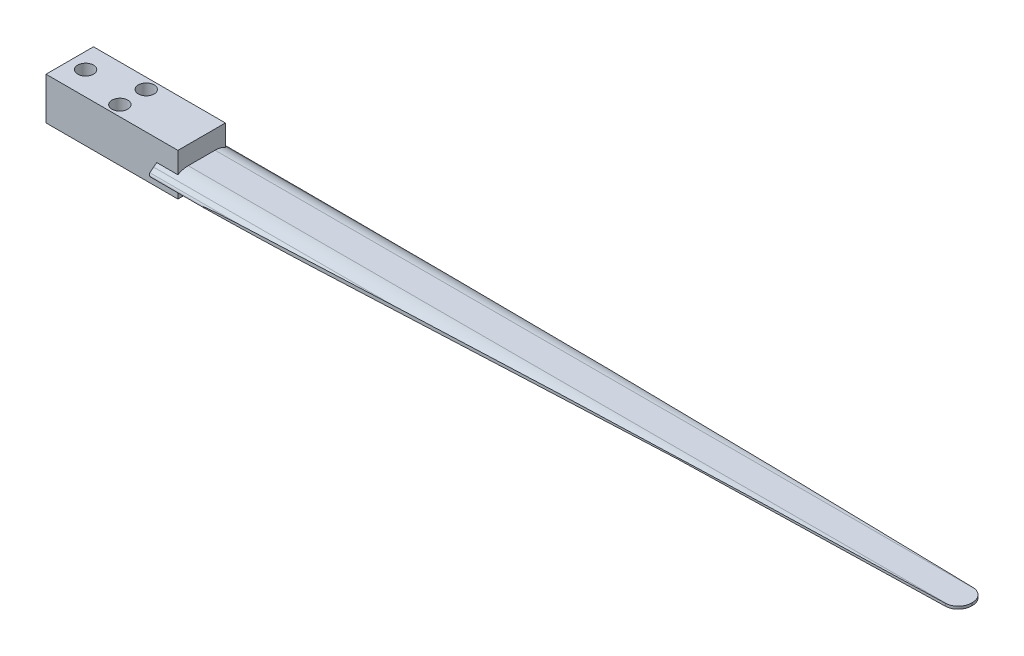
ISO-10303-21;
HEADER;
FILE_DESCRIPTION(('STEP AP214'),'2;1');
FILE_NAME('part.step','',(''),(''),'','','');
FILE_SCHEMA(('AUTOMOTIVE_DESIGN { 1 0 10303 214 1 1 1 1 }'));
ENDSEC;
DATA;
#1=APPLICATION_CONTEXT('core data for automotive mechanical design processes');
#2=APPLICATION_PROTOCOL_DEFINITION('international standard','automotive_design',2000,#1);
#3=PRODUCT_CONTEXT('',#1,'mechanical');
#4=PRODUCT('Part','Part','',(#3));
#5=PRODUCT_RELATED_PRODUCT_CATEGORY('part','',(#4));
#6=PRODUCT_DEFINITION_FORMATION('','',#4);
#7=PRODUCT_DEFINITION_CONTEXT('part definition',#1,'design');
#8=PRODUCT_DEFINITION('design','',#6,#7);
#9=PRODUCT_DEFINITION_SHAPE('','',#8);
#10=(LENGTH_UNIT() NAMED_UNIT(*) SI_UNIT(.MILLI.,.METRE.));
#11=(NAMED_UNIT(*) PLANE_ANGLE_UNIT() SI_UNIT($,.RADIAN.));
#12=(NAMED_UNIT(*) SI_UNIT($,.STERADIAN.) SOLID_ANGLE_UNIT());
#13=UNCERTAINTY_MEASURE_WITH_UNIT(LENGTH_MEASURE(1.E-05),#10,'distance_accuracy_value','');
#14=(GEOMETRIC_REPRESENTATION_CONTEXT(3) GLOBAL_UNCERTAINTY_ASSIGNED_CONTEXT((#13)) GLOBAL_UNIT_ASSIGNED_CONTEXT((#10,
#11,#12)) REPRESENTATION_CONTEXT('',''));
#15=CARTESIAN_POINT('',(0.,0.,0.));
#16=DIRECTION('',(0.,0.,1.));
#17=DIRECTION('',(1.,0.,0.));
#18=AXIS2_PLACEMENT_3D('',#15,#16,#17);
#19=CARTESIAN_POINT('',(1500.,-45.,-23.6213394580209));
#20=DIRECTION('',(1.,0.,0.));
#21=DIRECTION('',(0.,0.,-1.));
#22=AXIS2_PLACEMENT_3D('',#19,#20,#21);
#23=CYLINDRICAL_SURFACE('',#22,40.);
#24=CARTESIAN_POINT('',(40.,-45.,-23.6213394580209));
#25=DIRECTION('',(-1.,0.,0.));
#26=DIRECTION('',(0.,0.,1.));
#27=AXIS2_PLACEMENT_3D('',#24,#25,#26);
#28=CIRCLE('',#27,40.);
#29=CARTESIAN_POINT('',(40.,-11.1924139662292,-45.));
#30=VERTEX_POINT('',#29);
#31=CARTESIAN_POINT('',(40.,-5.,-23.6213394580209));
#32=VERTEX_POINT('',#31);
#33=EDGE_CURVE('E309',#30,#32,#28,.F.);
#34=ORIENTED_EDGE('',*,*,#33,.F.);
#35=DIRECTION('',(1.,0.,0.));
#36=VECTOR('',#35,1.);
#37=CARTESIAN_POINT('',(1500.,-11.1924139662292,-45.0000000000002));
#38=LINE('',#37,#36);
#39=CARTESIAN_POINT('',(0.,-11.1924139662291,-45.));
#40=VERTEX_POINT('',#39);
#41=EDGE_CURVE('E219',#40,#30,#38,.T.);
#42=ORIENTED_EDGE('',*,*,#41,.F.);
#43=CARTESIAN_POINT('',(0.,-45.,-23.6213394580209));
#44=DIRECTION('',(-1.,0.,0.));
#45=DIRECTION('',(0.,0.,1.));
#46=AXIS2_PLACEMENT_3D('',#43,#44,#45);
#47=CIRCLE('',#46,40.);
#48=CARTESIAN_POINT('',(0.,-14.3582222752409,-49.3328438454825));
#49=VERTEX_POINT('',#48);
#50=EDGE_CURVE('E398',#49,#40,#47,.F.);
#51=ORIENTED_EDGE('',*,*,#50,.F.);
#52=DIRECTION('',(-1.,0.,0.));
#53=VECTOR('',#52,1.);
#54=CARTESIAN_POINT('',(4.44089209850063E-13,-14.3582222752409,-49.3328438454825));
#55=LINE('',#54,#53);
#56=CARTESIAN_POINT('',(530.518621133797,-14.3582222752409,-49.3328438454825));
#57=VERTEX_POINT('',#56);
#58=EDGE_CURVE('E382',#57,#49,#55,.T.);
#59=ORIENTED_EDGE('',*,*,#58,.F.);
#60=CARTESIAN_POINT('',(1573.84636830917,-45.,-23.6213394580209));
#61=DIRECTION('',(0.0246362665328638,0.,-0.999696481123807));
#62=DIRECTION('',(0.999696481123807,0.,0.0246362665328638));
#63=AXIS2_PLACEMENT_3D('',#60,#61,#62);
#64=ELLIPSE('',#63,1623.62263562304,40.);
#65=CARTESIAN_POINT('',(1475.61590666332,-5.07331858080218,-26.042106041127));
#66=VERTEX_POINT('',#65);
#67=EDGE_CURVE('E332',#66,#57,#64,.F.);
#68=ORIENTED_EDGE('',*,*,#67,.F.);
#69=CARTESIAN_POINT('',(1475.61590666332,-5.07331858080218,-26.042106041127));
#70=CARTESIAN_POINT('',(1475.9700700259,-5.07279862859968,-26.0333826054804));
#71=CARTESIAN_POINT('',(1476.32404367951,-5.07180690533181,-26.0171221724049));
#72=CARTESIAN_POINT('',(1477.03097953139,-5.06897777633234,-25.9695770585497));
#73=CARTESIAN_POINT('',(1477.3839417231,-5.06714036512705,-25.9382922805256));
#74=CARTESIAN_POINT('',(1478.08841122464,-5.06271651587361,-25.8607270646541));
#75=CARTESIAN_POINT('',(1478.43991762994,-5.0601296674009,-25.8144384083733));
#76=CARTESIAN_POINT('',(1479.14061442849,-5.05437400914434,-25.7069642843364));
#77=CARTESIAN_POINT('',(1479.4898048499,-5.05120520644786,-25.6457789979973));
#78=CARTESIAN_POINT('',(1480.52090876374,-5.04124346477607,-25.4424078786907));
#79=CARTESIAN_POINT('',(1481.19875552388,-5.03390388093091,-25.2790304874285));
#80=CARTESIAN_POINT('',(1482.53799259359,-5.01986907112326,-24.8963572824213));
#81=CARTESIAN_POINT('',(1483.19939360256,-5.01317341763897,-24.6770989274508));
#82=CARTESIAN_POINT('',(1484.17135972117,-5.00573113413443,-24.3091875915255));
#83=CARTESIAN_POINT('',(1484.48981667851,-5.00368938011538,-24.1810833500194));
#84=CARTESIAN_POINT('',(1485.12256234085,-5.00082311444926,-23.9112888288626));
#85=CARTESIAN_POINT('',(1485.43682695597,-5.00000392433202,-23.7695419962997));
#86=CARTESIAN_POINT('',(1485.74806130917,-5.,-23.6213394580209));
#87=B_SPLINE_CURVE_WITH_KNOTS('',3,(#69,#70,#71,#72,#73,#74,#75,#76,#77,#78,#79,#80,#81,#82,#83,
#84,#85,#86),.UNSPECIFIED.,.F.,.F.,(4,2,2,2,2,2,2,2,4),(0.,1.06272685519985,2.12546058895862,
3.18877742580483,4.25208131380669,6.3413788539179,8.42927953870252,9.45881382358197,
10.492816487559),.UNSPECIFIED.);
#88=CARTESIAN_POINT('',(1485.74806130917,-5.,-23.6213394580209));
#89=VERTEX_POINT('',#88);
#90=EDGE_CURVE('E499',#66,#89,#87,.T.);
#91=ORIENTED_EDGE('',*,*,#90,.T.);
#92=DIRECTION('',(-1.,0.,0.));
#93=VECTOR('',#92,1.);
#94=CARTESIAN_POINT('',(1500.,-5.,-23.6213394580209));
#95=LINE('',#94,#93);
#96=EDGE_CURVE('E385',#32,#89,#95,.F.);
#97=ORIENTED_EDGE('',*,*,#96,.F.);
#98=EDGE_LOOP('',(#34,#42,#51,#59,#68,#91,#97));
#99=FACE_BOUND('',#98,.T.);
#100=ADVANCED_FACE('F42',(#99),#23,.F.);
#101=CARTESIAN_POINT('',(1500.,-40.,-25.4411906293519));
#102=DIRECTION('',(-1.,0.,0.));
#103=DIRECTION('',(0.,0.,1.));
#104=AXIS2_PLACEMENT_3D('',#101,#102,#103);
#105=CYLINDRICAL_SURFACE('',#104,40.);
#106=DIRECTION('',(-1.,0.,0.));
#107=VECTOR('',#106,1.);
#108=CARTESIAN_POINT('',(1500.,-5.10798119909597,-45.0000000000002));
#109=LINE('',#108,#107);
#110=CARTESIAN_POINT('',(0.,-5.10798119909588,-45.));
#111=VERTEX_POINT('',#110);
#112=CARTESIAN_POINT('',(40.,-5.10798119909597,-45.));
#113=VERTEX_POINT('',#112);
#114=EDGE_CURVE('E312',#111,#113,#109,.F.);
#115=ORIENTED_EDGE('',*,*,#114,.T.);
#116=CARTESIAN_POINT('',(40.,-40.,-25.4411906293519));
#117=DIRECTION('',(-1.,0.,0.));
#118=DIRECTION('',(0.,0.,1.));
#119=AXIS2_PLACEMENT_3D('',#116,#117,#118);
#120=CIRCLE('',#119,40.);
#121=CARTESIAN_POINT('',(40.,0.,-25.4411906293519));
#122=VERTEX_POINT('',#121);
#123=EDGE_CURVE('E299',#113,#122,#120,.F.);
#124=ORIENTED_EDGE('',*,*,#123,.T.);
#125=DIRECTION('',(-1.,0.,0.));
#126=VECTOR('',#125,1.);
#127=CARTESIAN_POINT('',(1500.,0.,-25.4411906293519));
#128=LINE('',#127,#126);
#129=CARTESIAN_POINT('',(1480.48223429051,0.,-25.4411906293519));
#130=VERTEX_POINT('',#129);
#131=EDGE_CURVE('E402',#130,#122,#128,.T.);
#132=ORIENTED_EDGE('',*,*,#131,.F.);
#133=CARTESIAN_POINT('',(1480.48223429051,0.,-25.4411906293519));
#134=CARTESIAN_POINT('',(1480.0824506636,-1.40918746666799E-05,-25.5310543039378));
#135=CARTESIAN_POINT('',(1479.68045536223,-0.000302843564792371,-25.6110730483464));
#136=CARTESIAN_POINT('',(1478.87399038358,-0.00113589639994079,-25.7510946337541));
#137=CARTESIAN_POINT('',(1478.46952898568,-0.00167958108243351,-25.8111451651411));
#138=CARTESIAN_POINT('',(1477.6581477831,-0.00273161127610693,-25.911338062827));
#139=CARTESIAN_POINT('',(1477.25122797828,-0.00323995678526456,-25.9514804279862));
#140=CARTESIAN_POINT('',(1476.43492656731,-0.00406313910998004,-26.0118451293585));
#141=CARTESIAN_POINT('',(1476.02554139089,-0.00437750632015445,-26.0320191946758));
#142=CARTESIAN_POINT('',(1475.61590666332,-0.00451399635339535,-26.042106041127));
#143=B_SPLINE_CURVE_WITH_KNOTS('',3,(#133,#134,#135,#136,#137,#138,#139,#140,#141,#142),
.UNSPECIFIED.,.F.,.F.,(4,2,2,2,4),(0.,1.22915127292536,2.45534549967598,3.68153979662248,
4.91069107970537),.UNSPECIFIED.);
#144=CARTESIAN_POINT('',(1475.61590666332,-0.00451399635340022,-26.042106041127));
#145=VERTEX_POINT('',#144);
#146=EDGE_CURVE('E476',#130,#145,#143,.T.);
#147=ORIENTED_EDGE('',*,*,#146,.T.);
#148=CARTESIAN_POINT('',(1500.,-40.,-25.4411906293519));
#149=DIRECTION('',(0.0246362665328638,0.,-0.999696481123807));
#150=DIRECTION('',(-0.999696481123807,0.,-0.0246362665328638));
#151=AXIS2_PLACEMENT_3D('',#148,#149,#150);
#152=ELLIPSE('',#151,1623.62263562304,40.);
#153=CARTESIAN_POINT('',(456.672252824631,-9.35822227524092,-51.1526950168135));
#154=VERTEX_POINT('',#153);
#155=EDGE_CURVE('E457',#145,#154,#152,.F.);
#156=ORIENTED_EDGE('',*,*,#155,.T.);
#157=DIRECTION('',(-1.,0.,0.));
#158=VECTOR('',#157,1.);
#159=CARTESIAN_POINT('',(1500.,-9.35822227524092,-51.1526950168135));
#160=LINE('',#159,#158);
#161=CARTESIAN_POINT('',(0.,-9.35822227524091,-51.1526950168135));
#162=VERTEX_POINT('',#161);
#163=EDGE_CURVE('E409',#162,#154,#160,.F.);
#164=ORIENTED_EDGE('',*,*,#163,.F.);
#165=CARTESIAN_POINT('',(0.,-40.,-25.4411906293519));
#166=DIRECTION('',(-1.,0.,0.));
#167=DIRECTION('',(0.,0.,1.));
#168=AXIS2_PLACEMENT_3D('',#165,#166,#167);
#169=CIRCLE('',#168,40.);
#170=EDGE_CURVE('E406',#111,#162,#169,.T.);
#171=ORIENTED_EDGE('',*,*,#170,.F.);
#172=EDGE_LOOP('',(#115,#124,#132,#147,#156,#164,#171));
#173=FACE_BOUND('',#172,.T.);
#174=ADVANCED_FACE('F486',(#173),#105,.T.);
#175=CARTESIAN_POINT('',(1500.,0.,0.));
#176=DIRECTION('',(0.,-1.,0.));
#177=DIRECTION('',(0.,0.,-1.));
#178=AXIS2_PLACEMENT_3D('',#175,#176,#177);
#179=PLANE('',#178);
#180=DIRECTION('',(0.,0.,-1.));
#181=VECTOR('',#180,1.);
#182=CARTESIAN_POINT('',(40.,0.,2.25128557771212E-13));
#183=LINE('',#182,#181);
#184=CARTESIAN_POINT('',(40.,0.,25.4411906293519));
#185=VERTEX_POINT('',#184);
#186=EDGE_CURVE('E296',#185,#122,#183,.T.);
#187=ORIENTED_EDGE('',*,*,#186,.F.);
#188=DIRECTION('',(-1.,0.,0.));
#189=VECTOR('',#188,1.);
#190=CARTESIAN_POINT('',(1500.,0.,25.4411906293519));
#191=LINE('',#190,#189);
#192=CARTESIAN_POINT('',(1480.48223429051,0.,25.4411906293519));
#193=VERTEX_POINT('',#192);
#194=EDGE_CURVE('E395',#185,#193,#191,.F.);
#195=ORIENTED_EDGE('',*,*,#194,.T.);
#196=CARTESIAN_POINT('',(1475.,0.,1.04969401303179));
#197=DIRECTION('',(0.,-1.,0.));
#198=DIRECTION('',(0.,0.,-1.));
#199=AXIS2_PLACEMENT_3D('',#196,#197,#198);
#200=CIRCLE('',#199,25.);
#201=CARTESIAN_POINT('',(1500.,0.,1.04969401303179));
#202=VERTEX_POINT('',#201);
#203=EDGE_CURVE('E470',#193,#202,#200,.F.);
#204=ORIENTED_EDGE('',*,*,#203,.T.);
#205=DIRECTION('',(0.,0.,1.));
#206=VECTOR('',#205,1.);
#207=CARTESIAN_POINT('',(1500.,0.,0.));
#208=LINE('',#207,#206);
#209=CARTESIAN_POINT('',(1500.,0.,-1.04969401303179));
#210=VERTEX_POINT('',#209);
#211=EDGE_CURVE('E353',#210,#202,#208,.T.);
#212=ORIENTED_EDGE('',*,*,#211,.F.);
#213=CARTESIAN_POINT('',(1475.,0.,-1.04969401303179));
#214=DIRECTION('',(0.,-1.,0.));
#215=DIRECTION('',(0.,0.,-1.));
#216=AXIS2_PLACEMENT_3D('',#213,#214,#215);
#217=CIRCLE('',#216,25.);
#218=EDGE_CURVE('E473',#210,#130,#217,.F.);
#219=ORIENTED_EDGE('',*,*,#218,.T.);
#220=ORIENTED_EDGE('',*,*,#131,.T.);
#221=EDGE_LOOP('',(#187,#195,#204,#212,#219,#220));
#222=FACE_BOUND('',#221,.T.);
#223=ADVANCED_FACE('F543',(#222),#179,.F.);
#224=CARTESIAN_POINT('',(1500.,-5.,38.180148828669));
#225=DIRECTION('',(0.,0.766044443118977,0.64278760968654));
#226=DIRECTION('',(0.,-0.64278760968654,0.766044443118977));
#227=AXIS2_PLACEMENT_3D('',#224,#225,#226);
#228=PLANE('',#227);
#229=DIRECTION('',(0.,-0.64278760968654,0.766044443118977));
#230=VECTOR('',#229,1.);
#231=CARTESIAN_POINT('',(40.,-5.00000000000011,38.1801488286691));
#232=LINE('',#231,#230);
#233=CARTESIAN_POINT('',(40.,-5.,38.180148828669));
#234=VERTEX_POINT('',#233);
#235=CARTESIAN_POINT('',(40.,-10.7225346025478,45.));
#236=VERTEX_POINT('',#235);
#237=EDGE_CURVE('E306',#234,#236,#232,.T.);
#238=ORIENTED_EDGE('',*,*,#237,.F.);
#239=DIRECTION('',(-1.,0.,0.));
#240=VECTOR('',#239,1.);
#241=CARTESIAN_POINT('',(1500.,-5.,38.180148828669));
#242=LINE('',#241,#240);
#243=CARTESIAN_POINT('',(983.075421835833,-5.,38.180148828669));
#244=VERTEX_POINT('',#243);
#245=EDGE_CURVE('E362',#244,#234,#242,.T.);
#246=ORIENTED_EDGE('',*,*,#245,.F.);
#247=DIRECTION('',(-0.999482942790487,-0.0206678664963949,0.0246310041483361));
#248=VECTOR('',#247,1.);
#249=CARTESIAN_POINT('',(1499.46557903901,5.67820407152739,25.4543607639721));
#250=LINE('',#249,#248);
#251=CARTESIAN_POINT('',(304.465496194478,-19.0326750420833,54.9036397237788));
#252=VERTEX_POINT('',#251);
#253=EDGE_CURVE('E345',#244,#252,#250,.T.);
#254=ORIENTED_EDGE('',*,*,#253,.T.);
#255=DIRECTION('',(-1.,0.,0.));
#256=VECTOR('',#255,1.);
#257=CARTESIAN_POINT('',(1500.,-19.0326750420833,54.9036397237788));
#258=LINE('',#257,#256);
#259=CARTESIAN_POINT('',(0.,-19.0326750420833,54.9036397237788));
#260=VERTEX_POINT('',#259);
#261=EDGE_CURVE('E440',#252,#260,#258,.T.);
#262=ORIENTED_EDGE('',*,*,#261,.T.);
#263=DIRECTION('',(0.,0.64278760968654,-0.766044443118977));
#264=VECTOR('',#263,1.);
#265=CARTESIAN_POINT('',(0.,-5.,38.180148828669));
#266=LINE('',#265,#264);
#267=CARTESIAN_POINT('',(0.,-10.7225346025478,45.));
#268=VERTEX_POINT('',#267);
#269=EDGE_CURVE('E372',#260,#268,#266,.T.);
#270=ORIENTED_EDGE('',*,*,#269,.T.);
#271=DIRECTION('',(-1.,0.,0.));
#272=VECTOR('',#271,1.);
#273=CARTESIAN_POINT('',(1500.,-10.7225346025476,44.9999999999997));
#274=LINE('',#273,#272);
#275=EDGE_CURVE('E293',#236,#268,#274,.T.);
#276=ORIENTED_EDGE('',*,*,#275,.F.);
#277=EDGE_LOOP('',(#238,#246,#254,#262,#270,#276));
#278=FACE_BOUND('',#277,.T.);
#279=ADVANCED_FACE('F586',(#278),#228,.F.);
#280=CARTESIAN_POINT('',(1500.,-5.,0.));
#281=DIRECTION('',(0.,1.,0.));
#282=DIRECTION('',(0.,0.,1.));
#283=AXIS2_PLACEMENT_3D('',#280,#281,#282);
#284=PLANE('',#283);
#285=DIRECTION('',(0.,0.,1.));
#286=VECTOR('',#285,1.);
#287=CARTESIAN_POINT('',(40.,-5.,2.25128557771212E-13));
#288=LINE('',#287,#286);
#289=EDGE_CURVE('E303',#32,#234,#288,.T.);
#290=ORIENTED_EDGE('',*,*,#289,.F.);
#291=ORIENTED_EDGE('',*,*,#96,.T.);
#292=CARTESIAN_POINT('',(1475.,-5.,-1.04969401303179));
#293=DIRECTION('',(0.,1.,0.));
#294=DIRECTION('',(0.,0.,1.));
#295=AXIS2_PLACEMENT_3D('',#292,#293,#294);
#296=CIRCLE('',#295,25.);
#297=CARTESIAN_POINT('',(1500.,-5.,-1.04969401303179));
#298=VERTEX_POINT('',#297);
#299=EDGE_CURVE('E559',#89,#298,#296,.F.);
#300=ORIENTED_EDGE('',*,*,#299,.T.);
#301=DIRECTION('',(0.,0.,-1.));
#302=VECTOR('',#301,1.);
#303=CARTESIAN_POINT('',(1500.,-5.,0.));
#304=LINE('',#303,#302);
#305=CARTESIAN_POINT('',(1500.,-5.,1.04969401303179));
#306=VERTEX_POINT('',#305);
#307=EDGE_CURVE('E357',#306,#298,#304,.T.);
#308=ORIENTED_EDGE('',*,*,#307,.F.);
#309=CARTESIAN_POINT('',(1475.,-5.,1.04969401303179));
#310=DIRECTION('',(0.,1.,0.));
#311=DIRECTION('',(0.,0.,1.));
#312=AXIS2_PLACEMENT_3D('',#309,#310,#311);
#313=CIRCLE('',#312,25.);
#314=CARTESIAN_POINT('',(1475.61590666332,-5.,26.042106041127));
#315=VERTEX_POINT('',#314);
#316=EDGE_CURVE('E508',#306,#315,#313,.F.);
#317=ORIENTED_EDGE('',*,*,#316,.T.);
#318=DIRECTION('',(-0.999696481123807,0.,0.0246362665328638));
#319=VECTOR('',#318,1.);
#320=CARTESIAN_POINT('',(1500.62658571493,-5.,25.425749209911));
#321=LINE('',#320,#319);
#322=EDGE_CURVE('E349',#315,#244,#321,.T.);
#323=ORIENTED_EDGE('',*,*,#322,.T.);
#324=ORIENTED_EDGE('',*,*,#245,.T.);
#325=EDGE_LOOP('',(#290,#291,#300,#308,#317,#323,#324));
#326=FACE_BOUND('',#325,.T.);
#327=ADVANCED_FACE('F590',(#326),#284,.F.);
#328=CARTESIAN_POINT('',(0.,0.,0.));
#329=DIRECTION('',(-1.,0.,0.));
#330=DIRECTION('',(0.,0.,1.));
#331=AXIS2_PLACEMENT_3D('',#328,#329,#330);
#332=PLANE('',#331);
#333=ORIENTED_EDGE('',*,*,#50,.T.);
#334=DIRECTION('',(0.,1.,0.));
#335=VECTOR('',#334,1.);
#336=CARTESIAN_POINT('',(0.,0.,-45.));
#337=LINE('',#336,#335);
#338=EDGE_CURVE('E11',#40,#111,#337,.T.);
#339=ORIENTED_EDGE('',*,*,#338,.T.);
#340=ORIENTED_EDGE('',*,*,#170,.T.);
#341=DIRECTION('',(0.,0.64278760968654,0.766044443118977));
#342=VECTOR('',#341,1.);
#343=CARTESIAN_POINT('',(0.,0.,-40.));
#344=LINE('',#343,#342);
#345=CARTESIAN_POINT('',(0.,-15.2024528264884,-58.1175777722115));
#346=VERTEX_POINT('',#345);
#347=EDGE_CURVE('E363',#346,#162,#344,.T.);
#348=ORIENTED_EDGE('',*,*,#347,.F.);
#349=DIRECTION('',(0.,0.766044443118977,-0.64278760968654));
#350=VECTOR('',#349,1.);
#351=CARTESIAN_POINT('',(0.,-15.2024528264884,-58.1175777722115));
#352=LINE('',#351,#350);
#353=CARTESIAN_POINT('',(0.,-19.0326750420833,-54.9036397237788));
#354=VERTEX_POINT('',#353);
#355=EDGE_CURVE('E420',#346,#354,#352,.F.);
#356=ORIENTED_EDGE('',*,*,#355,.T.);
#357=DIRECTION('',(0.,-0.64278760968654,-0.766044443118977));
#358=VECTOR('',#357,1.);
#359=CARTESIAN_POINT('',(0.,-5.,-38.180148828669));
#360=LINE('',#359,#358);
#361=EDGE_CURVE('E358',#49,#354,#360,.T.);
#362=ORIENTED_EDGE('',*,*,#361,.F.);
#363=EDGE_LOOP('',(#333,#339,#340,#348,#356,#362));
#364=FACE_BOUND('',#363,.T.);
#365=ADVANCED_FACE('F618',(#364),#332,.T.);
#366=CARTESIAN_POINT('',(0.,-40.,25.4411906293519));
#367=DIRECTION('',(-1.,0.,0.));
#368=DIRECTION('',(0.,0.,1.));
#369=AXIS2_PLACEMENT_3D('',#366,#367,#368);
#370=CIRCLE('',#369,40.);
#371=CARTESIAN_POINT('',(0.,-9.35822227524091,51.1526950168135));
#372=VERTEX_POINT('',#371);
#373=CARTESIAN_POINT('',(0.,-5.10798119909573,44.9999999999997));
#374=VERTEX_POINT('',#373);
#375=EDGE_CURVE('E391',#372,#374,#370,.T.);
#376=ORIENTED_EDGE('',*,*,#375,.T.);
#377=DIRECTION('',(0.,-1.,0.));
#378=VECTOR('',#377,1.);
#379=CARTESIAN_POINT('',(0.,0.,45.));
#380=LINE('',#379,#378);
#381=EDGE_CURVE('E59',#374,#268,#380,.T.);
#382=ORIENTED_EDGE('',*,*,#381,.T.);
#383=ORIENTED_EDGE('',*,*,#269,.F.);
#384=DIRECTION('',(0.,-0.766044443118977,-0.64278760968654));
#385=VECTOR('',#384,1.);
#386=CARTESIAN_POINT('',(0.,-15.2024528264884,58.1175777722115));
#387=LINE('',#386,#385);
#388=CARTESIAN_POINT('',(0.,-15.2024528264884,58.1175777722115));
#389=VERTEX_POINT('',#388);
#390=EDGE_CURVE('E443',#260,#389,#387,.F.);
#391=ORIENTED_EDGE('',*,*,#390,.T.);
#392=DIRECTION('',(0.,-0.64278760968654,0.766044443118977));
#393=VECTOR('',#392,1.);
#394=CARTESIAN_POINT('',(0.,0.,40.));
#395=LINE('',#394,#393);
#396=EDGE_CURVE('E367',#372,#389,#395,.T.);
#397=ORIENTED_EDGE('',*,*,#396,.F.);
#398=EDGE_LOOP('',(#376,#382,#383,#391,#397));
#399=FACE_BOUND('',#398,.T.);
#400=ADVANCED_FACE('F520',(#399),#332,.T.);
#401=CARTESIAN_POINT('',(1500.,-40.,25.4411906293519));
#402=DIRECTION('',(-1.,0.,0.));
#403=DIRECTION('',(0.,0.,1.));
#404=AXIS2_PLACEMENT_3D('',#401,#402,#403);
#405=CYLINDRICAL_SURFACE('',#404,40.);
#406=ORIENTED_EDGE('',*,*,#194,.F.);
#407=CARTESIAN_POINT('',(40.,-40.,25.4411906293519));
#408=DIRECTION('',(-1.,0.,0.));
#409=DIRECTION('',(0.,0.,1.));
#410=AXIS2_PLACEMENT_3D('',#407,#408,#409);
#411=CIRCLE('',#410,40.);
#412=CARTESIAN_POINT('',(40.,-5.10798119909573,45.));
#413=VERTEX_POINT('',#412);
#414=EDGE_CURVE('E52',#185,#413,#411,.F.);
#415=ORIENTED_EDGE('',*,*,#414,.T.);
#416=DIRECTION('',(-1.,0.,0.));
#417=VECTOR('',#416,1.);
#418=CARTESIAN_POINT('',(1500.,-5.10798119909573,44.9999999999997));
#419=LINE('',#418,#417);
#420=EDGE_CURVE('E530',#413,#374,#419,.T.);
#421=ORIENTED_EDGE('',*,*,#420,.T.);
#422=ORIENTED_EDGE('',*,*,#375,.F.);
#423=DIRECTION('',(-1.,0.,0.));
#424=VECTOR('',#423,1.);
#425=CARTESIAN_POINT('',(1500.,-9.35822227524092,51.1526950168135));
#426=LINE('',#425,#424);
#427=CARTESIAN_POINT('',(456.672252824631,-9.35822227524092,51.1526950168135));
#428=VERTEX_POINT('',#427);
#429=EDGE_CURVE('E388',#428,#372,#426,.T.);
#430=ORIENTED_EDGE('',*,*,#429,.F.);
#431=CARTESIAN_POINT('',(1500.,-40.,25.4411906293519));
#432=DIRECTION('',(-0.0246362665328638,0.,-0.999696481123807));
#433=DIRECTION('',(-0.999696481123807,0.,0.0246362665328638));
#434=AXIS2_PLACEMENT_3D('',#431,#432,#433);
#435=ELLIPSE('',#434,1623.62263562304,40.);
#436=CARTESIAN_POINT('',(1475.61590666332,-0.00451399635340022,26.042106041127));
#437=VERTEX_POINT('',#436);
#438=EDGE_CURVE('E460',#437,#428,#435,.F.);
#439=ORIENTED_EDGE('',*,*,#438,.F.);
#440=CARTESIAN_POINT('',(1475.61590666332,-0.00451399635340022,26.042106041127));
#441=CARTESIAN_POINT('',(1476.02554139089,-0.00437750632015968,26.0320191946758));
#442=CARTESIAN_POINT('',(1476.43492656731,-0.00406313910998152,26.0118451293585));
#443=CARTESIAN_POINT('',(1477.25122797828,-0.00323995678525978,25.9514804279862));
#444=CARTESIAN_POINT('',(1477.6581477831,-0.00273161127609968,25.9113380628271));
#445=CARTESIAN_POINT('',(1478.46952898568,-0.00167958108243167,25.8111451651412));
#446=CARTESIAN_POINT('',(1478.87399038358,-0.00113589639994682,25.7510946337541));
#447=CARTESIAN_POINT('',(1479.68045536223,-0.000302843564806057,25.6110730483465));
#448=CARTESIAN_POINT('',(1480.0824506636,-1.40918746801281E-05,25.5310543039379));
#449=CARTESIAN_POINT('',(1480.48223429051,0.,25.4411906293519));
#450=B_SPLINE_CURVE_WITH_KNOTS('',3,(#440,#441,#442,#443,#444,#445,#446,#447,#448,#449),
.UNSPECIFIED.,.F.,.F.,(4,2,2,2,4),(0.,1.22915128308289,2.45534558002917,3.68153980677979,
4.91069107970515),.UNSPECIFIED.);
#451=EDGE_CURVE('E67',#437,#193,#450,.T.);
#452=ORIENTED_EDGE('',*,*,#451,.T.);
#453=EDGE_LOOP('',(#406,#415,#421,#422,#430,#439,#452));
#454=FACE_BOUND('',#453,.T.);
#455=ADVANCED_FACE('F516',(#454),#405,.T.);
#456=CARTESIAN_POINT('',(1500.,-19.0326750420833,-54.9036397237788));
#457=DIRECTION('',(-1.,0.,0.));
#458=DIRECTION('',(0.,0.,1.));
#459=AXIS2_PLACEMENT_3D('',#456,#457,#458);
#460=CYLINDRICAL_SURFACE('',#459,5.);
#461=CARTESIAN_POINT('',(304.465496194478,-19.0326750420833,-54.9036397237788));
#462=DIRECTION('',(0.0246362665328638,0.,-0.999696481123807));
#463=DIRECTION('',(-0.999696481123807,0.,-0.0246362665328638));
#464=AXIS2_PLACEMENT_3D('',#461,#462,#463);
#465=ELLIPSE('',#464,202.95282945288,5.);
#466=CARTESIAN_POINT('',(174.049527797557,-15.2024528264884,-58.1175777722115));
#467=VERTEX_POINT('',#466);
#468=CARTESIAN_POINT('',(104.656640425595,-19.9009159304179,-59.8276784888398));
#469=VERTEX_POINT('',#468);
#470=EDGE_CURVE('E322',#467,#469,#465,.F.);
#471=ORIENTED_EDGE('',*,*,#470,.T.);
#472=DIRECTION('',(1.,0.,0.));
#473=VECTOR('',#472,1.);
#474=CARTESIAN_POINT('',(1500.,-19.9009159304179,-59.8276784888398));
#475=LINE('',#474,#473);
#476=CARTESIAN_POINT('',(2.49999999999989,-19.9009159304179,-59.8276784888398));
#477=VERTEX_POINT('',#476);
#478=EDGE_CURVE('E424',#477,#469,#475,.T.);
#479=ORIENTED_EDGE('',*,*,#478,.F.);
#480=CARTESIAN_POINT('',(4.99999999999989,-19.0326750420833,-54.9036397237788));
#481=DIRECTION('',(-0.707106781186547,-0.541675220419701,0.454519477672044));
#482=DIRECTION('',(0.707106781186547,-0.541675220419701,0.454519477672044));
#483=AXIS2_PLACEMENT_3D('',#480,#481,#482);
#484=ELLIPSE('',#483,7.07106781186547,5.);
#485=EDGE_CURVE('E368',#346,#477,#484,.T.);
#486=ORIENTED_EDGE('',*,*,#485,.F.);
#487=DIRECTION('',(-1.,0.,0.));
#488=VECTOR('',#487,1.);
#489=CARTESIAN_POINT('',(1500.,-15.2024528264884,-58.1175777722115));
#490=LINE('',#489,#488);
#491=EDGE_CURVE('E417',#467,#346,#490,.T.);
#492=ORIENTED_EDGE('',*,*,#491,.F.);
#493=EDGE_LOOP('',(#471,#479,#486,#492));
#494=FACE_BOUND('',#493,.T.);
#495=ADVANCED_FACE('F519',(#494),#460,.T.);
#496=CARTESIAN_POINT('',(1500.,-15.2024528264884,-58.1175777722115));
#497=DIRECTION('',(-1.,0.,0.));
#498=DIRECTION('',(0.,0.,1.));
#499=AXIS2_PLACEMENT_3D('',#496,#497,#498);
#500=CYLINDRICAL_SURFACE('',#499,5.);
#501=ORIENTED_EDGE('',*,*,#478,.T.);
#502=CARTESIAN_POINT('',(174.049527797557,-15.2024528264884,-58.1175777722115));
#503=DIRECTION('',(0.0246362665328638,0.,-0.999696481123807));
#504=DIRECTION('',(-0.999696481123807,0.,-0.0246362665328638));
#505=AXIS2_PLACEMENT_3D('',#502,#503,#504);
#506=ELLIPSE('',#505,202.95282945288,5.);
#507=CARTESIAN_POINT('',(304.465496194478,-19.0326750420833,-54.9036397237788));
#508=VERTEX_POINT('',#507);
#509=EDGE_CURVE('E325',#469,#508,#506,.F.);
#510=ORIENTED_EDGE('',*,*,#509,.T.);
#511=DIRECTION('',(-1.,0.,0.));
#512=VECTOR('',#511,1.);
#513=CARTESIAN_POINT('',(1500.,-19.0326750420833,-54.9036397237788));
#514=LINE('',#513,#512);
#515=EDGE_CURVE('E413',#354,#508,#514,.F.);
#516=ORIENTED_EDGE('',*,*,#515,.F.);
#517=CARTESIAN_POINT('',(4.99999999999989,-15.2024528264884,-58.1175777722115));
#518=DIRECTION('',(0.707106781186547,-0.541675220419701,0.454519477672044));
#519=DIRECTION('',(-0.707106781186547,-0.541675220419701,0.454519477672044));
#520=AXIS2_PLACEMENT_3D('',#517,#518,#519);
#521=ELLIPSE('',#520,7.07106781186547,5.);
#522=EDGE_CURVE('E425',#354,#477,#521,.T.);
#523=ORIENTED_EDGE('',*,*,#522,.T.);
#524=EDGE_LOOP('',(#501,#510,#516,#523));
#525=FACE_BOUND('',#524,.T.);
#526=ADVANCED_FACE('F606',(#525),#500,.T.);
#527=CARTESIAN_POINT('',(1500.,0.,-40.));
#528=DIRECTION('',(0.,-0.766044443118977,0.64278760968654));
#529=DIRECTION('',(0.,-0.64278760968654,-0.766044443118977));
#530=AXIS2_PLACEMENT_3D('',#527,#528,#529);
#531=PLANE('',#530);
#532=DIRECTION('',(0.999482942790487,0.0206678664963949,0.0246310041483361));
#533=VECTOR('',#532,1.);
#534=CARTESIAN_POINT('',(1499.38923318743,12.2036617960313,-25.456242211775));
#535=LINE('',#534,#533);
#536=EDGE_CURVE('E318',#467,#154,#535,.T.);
#537=ORIENTED_EDGE('',*,*,#536,.F.);
#538=ORIENTED_EDGE('',*,*,#491,.T.);
#539=ORIENTED_EDGE('',*,*,#347,.T.);
#540=ORIENTED_EDGE('',*,*,#163,.T.);
#541=EDGE_LOOP('',(#537,#538,#539,#540));
#542=FACE_BOUND('',#541,.T.);
#543=ADVANCED_FACE('F514',(#542),#531,.F.);
#544=CARTESIAN_POINT('',(1500.,-5.,-38.180148828669));
#545=DIRECTION('',(0.,0.766044443118977,-0.64278760968654));
#546=DIRECTION('',(0.,0.64278760968654,0.766044443118977));
#547=AXIS2_PLACEMENT_3D('',#544,#545,#546);
#548=PLANE('',#547);
#549=DIRECTION('',(-0.999482942790487,-0.0206678664963949,-0.0246310041483361));
#550=VECTOR('',#549,1.);
#551=CARTESIAN_POINT('',(1499.46557903901,5.67820407152739,-25.4543607639721));
#552=LINE('',#551,#550);
#553=EDGE_CURVE('E328',#57,#508,#552,.T.);
#554=ORIENTED_EDGE('',*,*,#553,.F.);
#555=ORIENTED_EDGE('',*,*,#58,.T.);
#556=ORIENTED_EDGE('',*,*,#361,.T.);
#557=ORIENTED_EDGE('',*,*,#515,.T.);
#558=EDGE_LOOP('',(#554,#555,#556,#557));
#559=FACE_BOUND('',#558,.T.);
#560=ADVANCED_FACE('F602',(#559),#548,.F.);
#561=CARTESIAN_POINT('',(1500.,0.,0.));
#562=DIRECTION('',(-1.,0.,0.));
#563=DIRECTION('',(0.,0.,1.));
#564=AXIS2_PLACEMENT_3D('',#561,#562,#563);
#565=PLANE('',#564);
#566=ORIENTED_EDGE('',*,*,#307,.T.);
#567=DIRECTION('',(0.,1.,0.));
#568=VECTOR('',#567,1.);
#569=CARTESIAN_POINT('',(1500.,0.,-1.04969401303179));
#570=LINE('',#569,#568);
#571=EDGE_CURVE('E466',#298,#210,#570,.T.);
#572=ORIENTED_EDGE('',*,*,#571,.T.);
#573=ORIENTED_EDGE('',*,*,#211,.T.);
#574=DIRECTION('',(0.,1.,0.));
#575=VECTOR('',#574,1.);
#576=CARTESIAN_POINT('',(1500.,0.,1.04969401303179));
#577=LINE('',#576,#575);
#578=EDGE_CURVE('E463',#202,#306,#577,.F.);
#579=ORIENTED_EDGE('',*,*,#578,.T.);
#580=EDGE_LOOP('',(#566,#572,#573,#579));
#581=FACE_BOUND('',#580,.T.);
#582=ADVANCED_FACE('F595',(#581),#565,.F.);
#583=CARTESIAN_POINT('',(4.99999999999989,-15.2024528264884,58.1175777722115));
#584=DIRECTION('',(0.,0.766044443118977,0.64278760968654));
#585=DIRECTION('',(0.,-0.64278760968654,0.766044443118977));
#586=AXIS2_PLACEMENT_3D('',#583,#584,#585);
#587=CYLINDRICAL_SURFACE('',#586,5.);
#588=CARTESIAN_POINT('',(4.99999999999989,-15.2024528264884,58.1175777722115));
#589=DIRECTION('',(-0.707106781186547,0.541675220419701,0.454519477672044));
#590=DIRECTION('',(0.707106781186547,0.541675220419701,0.454519477672044));
#591=AXIS2_PLACEMENT_3D('',#588,#589,#590);
#592=ELLIPSE('',#591,7.07106781186547,5.);
#593=CARTESIAN_POINT('',(2.49999999999989,-19.9009159304179,59.8276784888398));
#594=VERTEX_POINT('',#593);
#595=EDGE_CURVE('E429',#260,#594,#592,.T.);
#596=ORIENTED_EDGE('',*,*,#595,.T.);
#597=CARTESIAN_POINT('',(4.99999999999989,-19.0326750420833,54.9036397237788));
#598=DIRECTION('',(0.707106781186547,0.541675220419701,0.454519477672044));
#599=DIRECTION('',(-0.707106781186547,0.541675220419701,0.454519477672044));
#600=AXIS2_PLACEMENT_3D('',#597,#598,#599);
#601=ELLIPSE('',#600,7.07106781186547,5.);
#602=EDGE_CURVE('E352',#389,#594,#601,.T.);
#603=ORIENTED_EDGE('',*,*,#602,.F.);
#604=ORIENTED_EDGE('',*,*,#390,.F.);
#605=EDGE_LOOP('',(#596,#603,#604));
#606=FACE_BOUND('',#605,.T.);
#607=ADVANCED_FACE('F580',(#606),#587,.T.);
#608=CARTESIAN_POINT('',(1500.,-15.2024528264884,58.1175777722115));
#609=DIRECTION('',(-1.,0.,0.));
#610=DIRECTION('',(0.,0.,1.));
#611=AXIS2_PLACEMENT_3D('',#608,#609,#610);
#612=CYLINDRICAL_SURFACE('',#611,5.);
#613=CARTESIAN_POINT('',(174.049527797557,-15.2024528264884,58.1175777722115));
#614=DIRECTION('',(-0.0246362665328638,0.,-0.999696481123807));
#615=DIRECTION('',(-0.999696481123807,0.,0.0246362665328638));
#616=AXIS2_PLACEMENT_3D('',#613,#614,#615);
#617=ELLIPSE('',#616,202.95282945288,5.);
#618=CARTESIAN_POINT('',(104.656640425595,-19.9009159304179,59.8276784888398));
#619=VERTEX_POINT('',#618);
#620=EDGE_CURVE('E342',#619,#252,#617,.F.);
#621=ORIENTED_EDGE('',*,*,#620,.F.);
#622=DIRECTION('',(1.,0.,0.));
#623=VECTOR('',#622,1.);
#624=CARTESIAN_POINT('',(1500.,-19.9009159304179,59.8276784888398));
#625=LINE('',#624,#623);
#626=EDGE_CURVE('E447',#594,#619,#625,.T.);
#627=ORIENTED_EDGE('',*,*,#626,.F.);
#628=ORIENTED_EDGE('',*,*,#595,.F.);
#629=ORIENTED_EDGE('',*,*,#261,.F.);
#630=EDGE_LOOP('',(#621,#627,#628,#629));
#631=FACE_BOUND('',#630,.T.);
#632=ADVANCED_FACE('F496',(#631),#612,.T.);
#633=CARTESIAN_POINT('',(1500.,-19.0326750420833,54.9036397237788));
#634=DIRECTION('',(-1.,0.,0.));
#635=DIRECTION('',(0.,0.,1.));
#636=AXIS2_PLACEMENT_3D('',#633,#634,#635);
#637=CYLINDRICAL_SURFACE('',#636,5.);
#638=CARTESIAN_POINT('',(304.465496194478,-19.0326750420833,54.9036397237788));
#639=DIRECTION('',(-0.0246362665328638,0.,-0.999696481123807));
#640=DIRECTION('',(-0.999696481123807,0.,0.0246362665328638));
#641=AXIS2_PLACEMENT_3D('',#638,#639,#640);
#642=ELLIPSE('',#641,202.95282945288,5.);
#643=CARTESIAN_POINT('',(174.049527797557,-15.2024528264884,58.1175777722115));
#644=VERTEX_POINT('',#643);
#645=EDGE_CURVE('E339',#644,#619,#642,.F.);
#646=ORIENTED_EDGE('',*,*,#645,.F.);
#647=DIRECTION('',(-1.,0.,0.));
#648=VECTOR('',#647,1.);
#649=CARTESIAN_POINT('',(1500.,-15.2024528264884,58.1175777722115));
#650=LINE('',#649,#648);
#651=EDGE_CURVE('E436',#389,#644,#650,.F.);
#652=ORIENTED_EDGE('',*,*,#651,.F.);
#653=ORIENTED_EDGE('',*,*,#602,.T.);
#654=ORIENTED_EDGE('',*,*,#626,.T.);
#655=EDGE_LOOP('',(#646,#652,#653,#654));
#656=FACE_BOUND('',#655,.T.);
#657=ADVANCED_FACE('F577',(#656),#637,.T.);
#658=CARTESIAN_POINT('',(4.99999999999989,-15.2024528264884,-58.1175777722115));
#659=DIRECTION('',(0.,-0.766044443118977,0.64278760968654));
#660=DIRECTION('',(0.,-0.64278760968654,-0.766044443118977));
#661=AXIS2_PLACEMENT_3D('',#658,#659,#660);
#662=CYLINDRICAL_SURFACE('',#661,5.);
#663=ORIENTED_EDGE('',*,*,#485,.T.);
#664=ORIENTED_EDGE('',*,*,#522,.F.);
#665=ORIENTED_EDGE('',*,*,#355,.F.);
#666=EDGE_LOOP('',(#663,#664,#665));
#667=FACE_BOUND('',#666,.T.);
#668=ADVANCED_FACE('F616',(#667),#662,.T.);
#669=CARTESIAN_POINT('',(1500.,0.,40.));
#670=DIRECTION('',(0.,-0.766044443118977,-0.64278760968654));
#671=DIRECTION('',(0.,0.64278760968654,-0.766044443118977));
#672=AXIS2_PLACEMENT_3D('',#669,#670,#671);
#673=PLANE('',#672);
#674=ORIENTED_EDGE('',*,*,#651,.T.);
#675=DIRECTION('',(0.999482942790487,0.0206678664963949,-0.0246310041483361));
#676=VECTOR('',#675,1.);
#677=CARTESIAN_POINT('',(1499.38923318743,12.2036617960313,25.456242211775));
#678=LINE('',#677,#676);
#679=EDGE_CURVE('E335',#644,#428,#678,.T.);
#680=ORIENTED_EDGE('',*,*,#679,.T.);
#681=ORIENTED_EDGE('',*,*,#429,.T.);
#682=ORIENTED_EDGE('',*,*,#396,.T.);
#683=EDGE_LOOP('',(#674,#680,#681,#682));
#684=FACE_BOUND('',#683,.T.);
#685=ADVANCED_FACE('F570',(#684),#673,.F.);
#686=CARTESIAN_POINT('',(1.53700415794261,-20.2024528264884,-62.3689326513092));
#687=DIRECTION('',(0.0246362665328638,0.,-0.999696481123807));
#688=DIRECTION('',(-0.999696481123807,0.,-0.0246362665328638));
#689=AXIS2_PLACEMENT_3D('',#686,#687,#688);
#690=PLANE('',#689);
#691=ORIENTED_EDGE('',*,*,#155,.F.);
#692=DIRECTION('',(0.,1.,0.));
#693=VECTOR('',#692,1.);
#694=CARTESIAN_POINT('',(1475.61590666332,-5.04141967343927,-26.042106041127));
#695=LINE('',#694,#693);
#696=EDGE_CURVE('E484',#145,#66,#695,.F.);
#697=ORIENTED_EDGE('',*,*,#696,.T.);
#698=ORIENTED_EDGE('',*,*,#67,.T.);
#699=ORIENTED_EDGE('',*,*,#553,.T.);
#700=ORIENTED_EDGE('',*,*,#509,.F.);
#701=ORIENTED_EDGE('',*,*,#470,.F.);
#702=ORIENTED_EDGE('',*,*,#536,.T.);
#703=EDGE_LOOP('',(#691,#697,#698,#699,#700,#701,#702));
#704=FACE_BOUND('',#703,.T.);
#705=ADVANCED_FACE('F599',(#704),#690,.T.);
#706=CARTESIAN_POINT('',(1.53700415794261,-20.2024528264884,62.3689326513092));
#707=DIRECTION('',(-0.0246362665328638,0.,-0.999696481123807));
#708=DIRECTION('',(-0.999696481123807,0.,0.0246362665328638));
#709=AXIS2_PLACEMENT_3D('',#706,#707,#708);
#710=PLANE('',#709);
#711=ORIENTED_EDGE('',*,*,#322,.F.);
#712=DIRECTION('',(0.,1.,0.));
#713=VECTOR('',#712,1.);
#714=CARTESIAN_POINT('',(1475.61590666332,-20.2024528264884,26.042106041127));
#715=LINE('',#714,#713);
#716=EDGE_CURVE('E531',#315,#437,#715,.T.);
#717=ORIENTED_EDGE('',*,*,#716,.T.);
#718=ORIENTED_EDGE('',*,*,#438,.T.);
#719=ORIENTED_EDGE('',*,*,#679,.F.);
#720=ORIENTED_EDGE('',*,*,#645,.T.);
#721=ORIENTED_EDGE('',*,*,#620,.T.);
#722=ORIENTED_EDGE('',*,*,#253,.F.);
#723=EDGE_LOOP('',(#711,#717,#718,#719,#720,#721,#722));
#724=FACE_BOUND('',#723,.T.);
#725=ADVANCED_FACE('F494',(#724),#710,.F.);
#726=CARTESIAN_POINT('',(1475.,0.,-1.04969401303179));
#727=DIRECTION('',(0.,-1.,0.));
#728=DIRECTION('',(0.,0.,-1.));
#729=AXIS2_PLACEMENT_3D('',#726,#727,#728);
#730=CYLINDRICAL_SURFACE('',#729,25.);
#731=ORIENTED_EDGE('',*,*,#90,.F.);
#732=ORIENTED_EDGE('',*,*,#696,.F.);
#733=ORIENTED_EDGE('',*,*,#146,.F.);
#734=ORIENTED_EDGE('',*,*,#218,.F.);
#735=ORIENTED_EDGE('',*,*,#571,.F.);
#736=ORIENTED_EDGE('',*,*,#299,.F.);
#737=EDGE_LOOP('',(#731,#732,#733,#734,#735,#736));
#738=FACE_BOUND('',#737,.T.);
#739=ADVANCED_FACE('F490',(#738),#730,.T.);
#740=CARTESIAN_POINT('',(1475.,-20.2024528264884,1.04969401303179));
#741=DIRECTION('',(0.,1.,0.));
#742=DIRECTION('',(0.,0.,1.));
#743=AXIS2_PLACEMENT_3D('',#740,#741,#742);
#744=CYLINDRICAL_SURFACE('',#743,25.);
#745=ORIENTED_EDGE('',*,*,#316,.F.);
#746=ORIENTED_EDGE('',*,*,#578,.F.);
#747=ORIENTED_EDGE('',*,*,#203,.F.);
#748=ORIENTED_EDGE('',*,*,#451,.F.);
#749=ORIENTED_EDGE('',*,*,#716,.F.);
#750=EDGE_LOOP('',(#745,#746,#747,#748,#749));
#751=FACE_BOUND('',#750,.T.);
#752=ADVANCED_FACE('F44',(#751),#744,.T.);
#753=CARTESIAN_POINT('',(40.,35.,-45.));
#754=DIRECTION('',(0.,0.,1.));
#755=DIRECTION('',(1.,0.,0.));
#756=AXIS2_PLACEMENT_3D('',#753,#754,#755);
#757=PLANE('',#756);
#758=ORIENTED_EDGE('',*,*,#338,.F.);
#759=ORIENTED_EDGE('',*,*,#41,.T.);
#760=DIRECTION('',(0.,-1.,0.));
#761=VECTOR('',#760,1.);
#762=CARTESIAN_POINT('',(40.,35.,-45.));
#763=LINE('',#762,#761);
#764=CARTESIAN_POINT('',(40.,-45.,-45.));
#765=VERTEX_POINT('',#764);
#766=EDGE_CURVE('E213',#30,#765,#763,.T.);
#767=ORIENTED_EDGE('',*,*,#766,.T.);
#768=DIRECTION('',(-1.,0.,0.));
#769=VECTOR('',#768,1.);
#770=CARTESIAN_POINT('',(40.,-45.,-45.));
#771=LINE('',#770,#769);
#772=CARTESIAN_POINT('',(-210.,-45.,-45.));
#773=VERTEX_POINT('',#772);
#774=EDGE_CURVE('E217',#765,#773,#771,.T.);
#775=ORIENTED_EDGE('',*,*,#774,.T.);
#776=DIRECTION('',(0.,-1.,0.));
#777=VECTOR('',#776,1.);
#778=CARTESIAN_POINT('',(-210.,35.,-45.));
#779=LINE('',#778,#777);
#780=CARTESIAN_POINT('',(-210.,35.,-45.));
#781=VERTEX_POINT('',#780);
#782=EDGE_CURVE('E225',#781,#773,#779,.T.);
#783=ORIENTED_EDGE('',*,*,#782,.F.);
#784=DIRECTION('',(-1.,0.,0.));
#785=VECTOR('',#784,1.);
#786=CARTESIAN_POINT('',(40.,35.,-45.));
#787=LINE('',#786,#785);
#788=CARTESIAN_POINT('',(40.,35.,-45.));
#789=VERTEX_POINT('',#788);
#790=EDGE_CURVE('E271',#789,#781,#787,.T.);
#791=ORIENTED_EDGE('',*,*,#790,.F.);
#792=EDGE_CURVE('E224',#789,#113,#763,.T.);
#793=ORIENTED_EDGE('',*,*,#792,.T.);
#794=ORIENTED_EDGE('',*,*,#114,.F.);
#795=EDGE_LOOP('',(#758,#759,#767,#775,#783,#791,#793,#794));
#796=FACE_BOUND('',#795,.T.);
#797=ADVANCED_FACE('F215',(#796),#757,.F.);
#798=CARTESIAN_POINT('',(40.,35.,-45.));
#799=DIRECTION('',(-1.,0.,0.));
#800=DIRECTION('',(0.,0.,1.));
#801=AXIS2_PLACEMENT_3D('',#798,#799,#800);
#802=PLANE('',#801);
#803=ORIENTED_EDGE('',*,*,#766,.F.);
#804=ORIENTED_EDGE('',*,*,#33,.T.);
#805=ORIENTED_EDGE('',*,*,#289,.T.);
#806=ORIENTED_EDGE('',*,*,#237,.T.);
#807=DIRECTION('',(0.,-1.,0.));
#808=VECTOR('',#807,1.);
#809=CARTESIAN_POINT('',(40.,35.,45.));
#810=LINE('',#809,#808);
#811=CARTESIAN_POINT('',(40.,-45.,45.));
#812=VERTEX_POINT('',#811);
#813=EDGE_CURVE('E240',#236,#812,#810,.T.);
#814=ORIENTED_EDGE('',*,*,#813,.T.);
#815=DIRECTION('',(0.,0.,-1.));
#816=VECTOR('',#815,1.);
#817=CARTESIAN_POINT('',(40.,-45.,-45.));
#818=LINE('',#817,#816);
#819=EDGE_CURVE('E232',#812,#765,#818,.T.);
#820=ORIENTED_EDGE('',*,*,#819,.T.);
#821=EDGE_LOOP('',(#803,#804,#805,#806,#814,#820));
#822=FACE_BOUND('',#821,.T.);
#823=ADVANCED_FACE('F238',(#822),#802,.F.);
#824=CARTESIAN_POINT('',(40.,35.,45.));
#825=DIRECTION('',(0.,0.,-1.));
#826=DIRECTION('',(-1.,0.,0.));
#827=AXIS2_PLACEMENT_3D('',#824,#825,#826);
#828=PLANE('',#827);
#829=ORIENTED_EDGE('',*,*,#813,.F.);
#830=ORIENTED_EDGE('',*,*,#275,.T.);
#831=ORIENTED_EDGE('',*,*,#381,.F.);
#832=ORIENTED_EDGE('',*,*,#420,.F.);
#833=CARTESIAN_POINT('',(40.,35.,45.));
#834=VERTEX_POINT('',#833);
#835=EDGE_CURVE('E280',#834,#413,#810,.T.);
#836=ORIENTED_EDGE('',*,*,#835,.F.);
#837=DIRECTION('',(1.,0.,0.));
#838=VECTOR('',#837,1.);
#839=CARTESIAN_POINT('',(40.,35.,45.));
#840=LINE('',#839,#838);
#841=CARTESIAN_POINT('',(-210.,35.,45.));
#842=VERTEX_POINT('',#841);
#843=EDGE_CURVE('E277',#842,#834,#840,.T.);
#844=ORIENTED_EDGE('',*,*,#843,.F.);
#845=DIRECTION('',(0.,-1.,0.));
#846=VECTOR('',#845,1.);
#847=CARTESIAN_POINT('',(-210.,35.,45.));
#848=LINE('',#847,#846);
#849=CARTESIAN_POINT('',(-210.,-45.,45.));
#850=VERTEX_POINT('',#849);
#851=EDGE_CURVE('E284',#842,#850,#848,.T.);
#852=ORIENTED_EDGE('',*,*,#851,.T.);
#853=DIRECTION('',(1.,0.,0.));
#854=VECTOR('',#853,1.);
#855=CARTESIAN_POINT('',(40.,-45.,45.));
#856=LINE('',#855,#854);
#857=EDGE_CURVE('E252',#850,#812,#856,.T.);
#858=ORIENTED_EDGE('',*,*,#857,.T.);
#859=EDGE_LOOP('',(#829,#830,#831,#832,#836,#844,#852,#858));
#860=FACE_BOUND('',#859,.T.);
#861=ADVANCED_FACE('F621',(#860),#828,.F.);
#862=CARTESIAN_POINT('',(0.,35.,0.));
#863=DIRECTION('',(0.,-1.,0.));
#864=DIRECTION('',(0.,0.,-1.));
#865=AXIS2_PLACEMENT_3D('',#862,#863,#864);
#866=PLANE('',#865);
#867=DIRECTION('',(0.,0.,-1.));
#868=VECTOR('',#867,1.);
#869=CARTESIAN_POINT('',(40.,35.,-45.));
#870=LINE('',#869,#868);
#871=EDGE_CURVE('E267',#834,#789,#870,.T.);
#872=ORIENTED_EDGE('',*,*,#871,.T.);
#873=ORIENTED_EDGE('',*,*,#790,.T.);
#874=DIRECTION('',(0.,0.,1.));
#875=VECTOR('',#874,1.);
#876=CARTESIAN_POINT('',(-210.,35.,-45.));
#877=LINE('',#876,#875);
#878=EDGE_CURVE('E274',#781,#842,#877,.T.);
#879=ORIENTED_EDGE('',*,*,#878,.T.);
#880=ORIENTED_EDGE('',*,*,#843,.T.);
#881=EDGE_LOOP('',(#872,#873,#879,#880));
#882=FACE_BOUND('',#881,.T.);
#883=CARTESIAN_POINT('',(-90.,35.,-25.));
#884=DIRECTION('',(0.,1.,0.));
#885=DIRECTION('',(0.,0.,1.));
#886=AXIS2_PLACEMENT_3D('',#883,#884,#885);
#887=CIRCLE('',#886,15.);
#888=CARTESIAN_POINT('',(-90.,35.,-10.));
#889=VERTEX_POINT('',#888);
#890=EDGE_CURVE('E263',#889,#889,#887,.T.);
#891=ORIENTED_EDGE('',*,*,#890,.F.);
#892=EDGE_LOOP('',(#891));
#893=FACE_BOUND('',#892,.T.);
#894=CARTESIAN_POINT('',(-180.,35.,0.));
#895=DIRECTION('',(0.,1.,0.));
#896=DIRECTION('',(0.,0.,1.));
#897=AXIS2_PLACEMENT_3D('',#894,#895,#896);
#898=CIRCLE('',#897,15.);
#899=CARTESIAN_POINT('',(-180.,35.,15.));
#900=VERTEX_POINT('',#899);
#901=EDGE_CURVE('E259',#900,#900,#898,.T.);
#902=ORIENTED_EDGE('',*,*,#901,.F.);
#903=EDGE_LOOP('',(#902));
#904=FACE_BOUND('',#903,.T.);
#905=CARTESIAN_POINT('',(-90.,35.,25.));
#906=DIRECTION('',(0.,1.,0.));
#907=DIRECTION('',(0.,0.,1.));
#908=AXIS2_PLACEMENT_3D('',#905,#906,#907);
#909=CIRCLE('',#908,15.);
#910=CARTESIAN_POINT('',(-90.,35.,40.));
#911=VERTEX_POINT('',#910);
#912=EDGE_CURVE('E255',#911,#911,#909,.T.);
#913=ORIENTED_EDGE('',*,*,#912,.F.);
#914=EDGE_LOOP('',(#913));
#915=FACE_BOUND('',#914,.T.);
#916=ADVANCED_FACE('F628',(#882,#893,#904,#915),#866,.F.);
#917=ORIENTED_EDGE('',*,*,#123,.F.);
#918=ORIENTED_EDGE('',*,*,#792,.F.);
#919=ORIENTED_EDGE('',*,*,#871,.F.);
#920=ORIENTED_EDGE('',*,*,#835,.T.);
#921=ORIENTED_EDGE('',*,*,#414,.F.);
#922=ORIENTED_EDGE('',*,*,#186,.T.);
#923=EDGE_LOOP('',(#917,#918,#919,#920,#921,#922));
#924=FACE_BOUND('',#923,.T.);
#925=ADVANCED_FACE('F539',(#924),#802,.F.);
#926=CARTESIAN_POINT('',(-210.,35.,-45.));
#927=DIRECTION('',(1.,0.,0.));
#928=DIRECTION('',(0.,0.,-1.));
#929=AXIS2_PLACEMENT_3D('',#926,#927,#928);
#930=PLANE('',#929);
#931=ORIENTED_EDGE('',*,*,#782,.T.);
#932=DIRECTION('',(0.,0.,1.));
#933=VECTOR('',#932,1.);
#934=CARTESIAN_POINT('',(-210.,-45.,-45.));
#935=LINE('',#934,#933);
#936=EDGE_CURVE('E235',#773,#850,#935,.T.);
#937=ORIENTED_EDGE('',*,*,#936,.T.);
#938=ORIENTED_EDGE('',*,*,#851,.F.);
#939=ORIENTED_EDGE('',*,*,#878,.F.);
#940=EDGE_LOOP('',(#931,#937,#938,#939));
#941=FACE_BOUND('',#940,.T.);
#942=ADVANCED_FACE('F626',(#941),#930,.F.);
#943=CARTESIAN_POINT('',(-90.,35.,-25.));
#944=DIRECTION('',(0.,-1.,0.));
#945=DIRECTION('',(0.,0.,-1.));
#946=AXIS2_PLACEMENT_3D('',#943,#944,#945);
#947=CYLINDRICAL_SURFACE('',#946,15.);
#948=ORIENTED_EDGE('',*,*,#890,.T.);
#949=EDGE_LOOP('',(#948));
#950=FACE_BOUND('',#949,.T.);
#951=CARTESIAN_POINT('',(-90.,-45.,-25.));
#952=DIRECTION('',(0.,1.,0.));
#953=DIRECTION('',(0.,0.,1.));
#954=AXIS2_PLACEMENT_3D('',#951,#952,#953);
#955=CIRCLE('',#954,15.);
#956=CARTESIAN_POINT('',(-90.,-45.,-10.));
#957=VERTEX_POINT('',#956);
#958=EDGE_CURVE('E242',#957,#957,#955,.T.);
#959=ORIENTED_EDGE('',*,*,#958,.F.);
#960=EDGE_LOOP('',(#959));
#961=FACE_BOUND('',#960,.T.);
#962=ADVANCED_FACE('F656',(#950,#961),#947,.F.);
#963=CARTESIAN_POINT('',(-180.,35.,0.));
#964=DIRECTION('',(0.,-1.,0.));
#965=DIRECTION('',(0.,0.,-1.));
#966=AXIS2_PLACEMENT_3D('',#963,#964,#965);
#967=CYLINDRICAL_SURFACE('',#966,15.);
#968=ORIENTED_EDGE('',*,*,#901,.T.);
#969=EDGE_LOOP('',(#968));
#970=FACE_BOUND('',#969,.T.);
#971=CARTESIAN_POINT('',(-180.,-45.,0.));
#972=DIRECTION('',(0.,1.,0.));
#973=DIRECTION('',(0.,0.,1.));
#974=AXIS2_PLACEMENT_3D('',#971,#972,#973);
#975=CIRCLE('',#974,15.);
#976=CARTESIAN_POINT('',(-180.,-45.,15.));
#977=VERTEX_POINT('',#976);
#978=EDGE_CURVE('E246',#977,#977,#975,.T.);
#979=ORIENTED_EDGE('',*,*,#978,.F.);
#980=EDGE_LOOP('',(#979));
#981=FACE_BOUND('',#980,.T.);
#982=ADVANCED_FACE('F641',(#970,#981),#967,.F.);
#983=CARTESIAN_POINT('',(-90.,35.,25.));
#984=DIRECTION('',(0.,-1.,0.));
#985=DIRECTION('',(0.,0.,-1.));
#986=AXIS2_PLACEMENT_3D('',#983,#984,#985);
#987=CYLINDRICAL_SURFACE('',#986,15.);
#988=ORIENTED_EDGE('',*,*,#912,.T.);
#989=EDGE_LOOP('',(#988));
#990=FACE_BOUND('',#989,.T.);
#991=CARTESIAN_POINT('',(-90.,-45.,25.));
#992=DIRECTION('',(0.,1.,0.));
#993=DIRECTION('',(0.,0.,1.));
#994=AXIS2_PLACEMENT_3D('',#991,#992,#993);
#995=CIRCLE('',#994,15.);
#996=CARTESIAN_POINT('',(-90.,-45.,40.));
#997=VERTEX_POINT('',#996);
#998=EDGE_CURVE('E645',#997,#997,#995,.T.);
#999=ORIENTED_EDGE('',*,*,#998,.F.);
#1000=EDGE_LOOP('',(#999));
#1001=FACE_BOUND('',#1000,.T.);
#1002=ADVANCED_FACE('F638',(#990,#1001),#987,.F.);
#1003=CARTESIAN_POINT('',(0.,-45.,0.));
#1004=DIRECTION('',(0.,-1.,0.));
#1005=DIRECTION('',(0.,0.,-1.));
#1006=AXIS2_PLACEMENT_3D('',#1003,#1004,#1005);
#1007=PLANE('',#1006);
#1008=ORIENTED_EDGE('',*,*,#998,.T.);
#1009=EDGE_LOOP('',(#1008));
#1010=FACE_BOUND('',#1009,.T.);
#1011=ORIENTED_EDGE('',*,*,#978,.T.);
#1012=EDGE_LOOP('',(#1011));
#1013=FACE_BOUND('',#1012,.T.);
#1014=ORIENTED_EDGE('',*,*,#958,.T.);
#1015=EDGE_LOOP('',(#1014));
#1016=FACE_BOUND('',#1015,.T.);
#1017=ORIENTED_EDGE('',*,*,#819,.F.);
#1018=ORIENTED_EDGE('',*,*,#857,.F.);
#1019=ORIENTED_EDGE('',*,*,#936,.F.);
#1020=ORIENTED_EDGE('',*,*,#774,.F.);
#1021=EDGE_LOOP('',(#1017,#1018,#1019,#1020));
#1022=FACE_BOUND('',#1021,.T.);
#1023=ADVANCED_FACE('F230',(#1010,#1013,#1016,#1022),#1007,.T.);
#1024=CLOSED_SHELL('',(#100,#174,#223,#279,#327,#365,#400,#455,#495,#526,#543,#560,#582,#607,
#632,#657,#668,#685,#705,#725,#739,#752,#797,#823,#861,#916,#925,#942,#962,#982,#1002,#1023));
#1025=MANIFOLD_SOLID_BREP('B2',#1024);
#1026=ADVANCED_BREP_SHAPE_REPRESENTATION('',(#18,#1025),#14);
#1027=SHAPE_DEFINITION_REPRESENTATION(#9,#1026);
ENDSEC;
END-ISO-10303-21;
